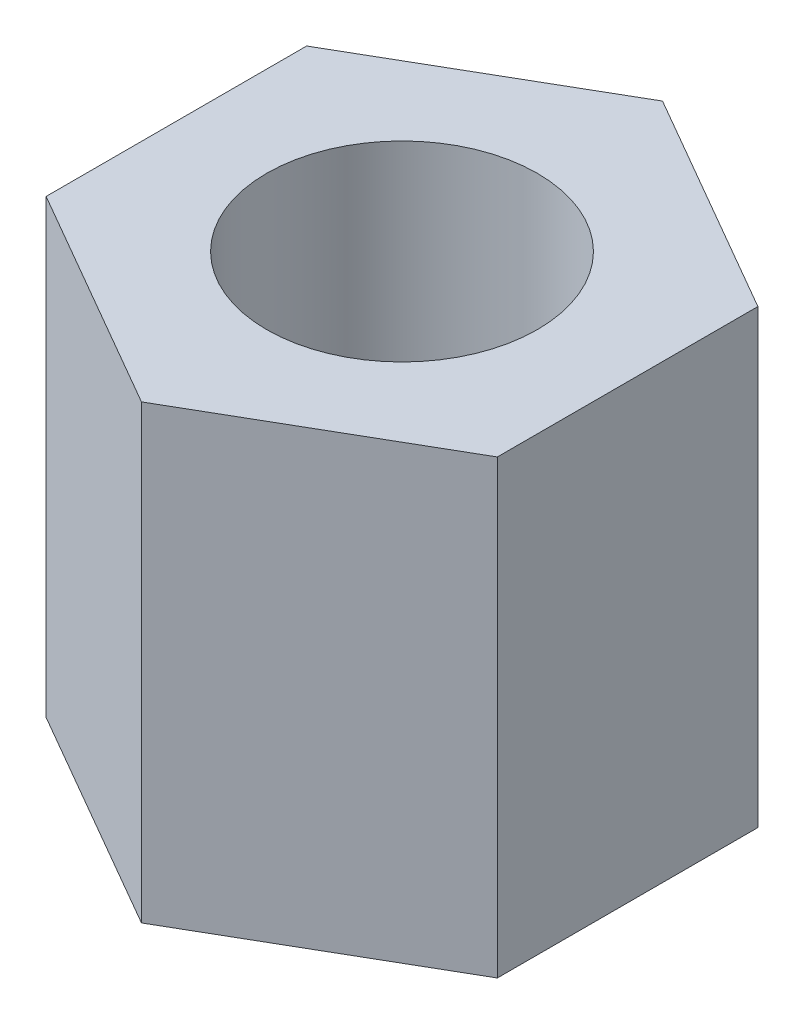
ISO-10303-21;
HEADER;
FILE_DESCRIPTION(('STEP AP214'),'2;1');
FILE_NAME('part.step','',(''),(''),'','','');
FILE_SCHEMA(('AUTOMOTIVE_DESIGN { 1 0 10303 214 1 1 1 1 }'));
ENDSEC;
DATA;
#1=APPLICATION_CONTEXT('core data for automotive mechanical design processes');
#2=APPLICATION_PROTOCOL_DEFINITION('international standard','automotive_design',2000,#1);
#3=PRODUCT_CONTEXT('',#1,'mechanical');
#4=PRODUCT('Part','Part','',(#3));
#5=PRODUCT_RELATED_PRODUCT_CATEGORY('part','',(#4));
#6=PRODUCT_DEFINITION_FORMATION('','',#4);
#7=PRODUCT_DEFINITION_CONTEXT('part definition',#1,'design');
#8=PRODUCT_DEFINITION('design','',#6,#7);
#9=PRODUCT_DEFINITION_SHAPE('','',#8);
#10=(LENGTH_UNIT() NAMED_UNIT(*) SI_UNIT(.MILLI.,.METRE.));
#11=(NAMED_UNIT(*) PLANE_ANGLE_UNIT() SI_UNIT($,.RADIAN.));
#12=(NAMED_UNIT(*) SI_UNIT($,.STERADIAN.) SOLID_ANGLE_UNIT());
#13=UNCERTAINTY_MEASURE_WITH_UNIT(LENGTH_MEASURE(1.E-05),#10,'distance_accuracy_value','');
#14=(GEOMETRIC_REPRESENTATION_CONTEXT(3) GLOBAL_UNCERTAINTY_ASSIGNED_CONTEXT((#13)) GLOBAL_UNIT_ASSIGNED_CONTEXT((#10,
#11,#12)) REPRESENTATION_CONTEXT('',''));
#15=CARTESIAN_POINT('',(0.,0.,0.));
#16=DIRECTION('',(0.,0.,1.));
#17=DIRECTION('',(1.,0.,0.));
#18=AXIS2_PLACEMENT_3D('',#15,#16,#17);
#19=CARTESIAN_POINT('',(0.,6.35,0.));
#20=DIRECTION('',(0.,1.,0.));
#21=DIRECTION('',(0.,0.,1.));
#22=AXIS2_PLACEMENT_3D('',#19,#20,#21);
#23=PLANE('',#22);
#24=DIRECTION('',(0.866025403784442,0.,0.499999999999995));
#25=VECTOR('',#24,1.);
#26=CARTESIAN_POINT('',(-3.17499999999998,6.35,1.8330871046771));
#27=LINE('',#26,#25);
#28=CARTESIAN_POINT('',(-3.17499999999998,6.35,1.8330871046771));
#29=VERTEX_POINT('',#28);
#30=CARTESIAN_POINT('',(0.,6.35,3.66617420935413));
#31=VERTEX_POINT('',#30);
#32=EDGE_CURVE('E129',#29,#31,#27,.T.);
#33=ORIENTED_EDGE('',*,*,#32,.T.);
#34=DIRECTION('',(0.866025403784438,0.,-0.500000000000001));
#35=VECTOR('',#34,1.);
#36=CARTESIAN_POINT('',(0.,6.35,3.66617420935413));
#37=LINE('',#36,#35);
#38=CARTESIAN_POINT('',(3.17500000000001,6.35,1.83308710467706));
#39=VERTEX_POINT('',#38);
#40=EDGE_CURVE('E87',#31,#39,#37,.T.);
#41=ORIENTED_EDGE('',*,*,#40,.T.);
#42=DIRECTION('',(0.,0.,-1.));
#43=VECTOR('',#42,1.);
#44=CARTESIAN_POINT('',(3.17500000000001,6.35,1.83308710467706));
#45=LINE('',#44,#43);
#46=CARTESIAN_POINT('',(3.17499999999999,6.35,-1.83308710467708));
#47=VERTEX_POINT('',#46);
#48=EDGE_CURVE('E100',#39,#47,#45,.T.);
#49=ORIENTED_EDGE('',*,*,#48,.T.);
#50=DIRECTION('',(-0.866025403784442,0.,-0.499999999999995));
#51=VECTOR('',#50,1.);
#52=CARTESIAN_POINT('',(3.17499999999999,6.35,-1.83308710467708));
#53=LINE('',#52,#51);
#54=CARTESIAN_POINT('',(0.,6.35,-3.66617420935413));
#55=VERTEX_POINT('',#54);
#56=EDGE_CURVE('E94',#47,#55,#53,.T.);
#57=ORIENTED_EDGE('',*,*,#56,.T.);
#58=DIRECTION('',(-0.866025403784435,0.,0.500000000000007));
#59=VECTOR('',#58,1.);
#60=CARTESIAN_POINT('',(0.,6.35,-3.66617420935413));
#61=LINE('',#60,#59);
#62=CARTESIAN_POINT('',(-3.17500000000002,6.35,-1.83308710467703));
#63=VERTEX_POINT('',#62);
#64=EDGE_CURVE('E98',#55,#63,#61,.T.);
#65=ORIENTED_EDGE('',*,*,#64,.T.);
#66=DIRECTION('',(0.,0.,1.));
#67=VECTOR('',#66,1.);
#68=CARTESIAN_POINT('',(-3.17500000000002,6.35,-1.83308710467703));
#69=LINE('',#68,#67);
#70=EDGE_CURVE('E50',#63,#29,#69,.T.);
#71=ORIENTED_EDGE('',*,*,#70,.T.);
#72=EDGE_LOOP('',(#33,#41,#49,#57,#65,#71));
#73=FACE_BOUND('',#72,.T.);
#74=CARTESIAN_POINT('',(0.,6.35,0.));
#75=DIRECTION('',(0.,1.,0.));
#76=DIRECTION('',(0.,0.,1.));
#77=AXIS2_PLACEMENT_3D('',#74,#75,#76);
#78=CIRCLE('',#77,1.905);
#79=CARTESIAN_POINT('',(0.,6.35,1.905));
#80=VERTEX_POINT('',#79);
#81=EDGE_CURVE('E122',#80,#80,#78,.T.);
#82=ORIENTED_EDGE('',*,*,#81,.F.);
#83=EDGE_LOOP('',(#82));
#84=FACE_BOUND('',#83,.T.);
#85=ADVANCED_FACE('F33',(#73,#84),#23,.T.);
#86=CARTESIAN_POINT('',(0.,0.,0.));
#87=DIRECTION('',(0.,1.,0.));
#88=DIRECTION('',(0.,0.,1.));
#89=AXIS2_PLACEMENT_3D('',#86,#87,#88);
#90=PLANE('',#89);
#91=DIRECTION('',(0.866025403784442,0.,0.499999999999995));
#92=VECTOR('',#91,1.);
#93=CARTESIAN_POINT('',(-3.17499999999998,0.,1.8330871046771));
#94=LINE('',#93,#92);
#95=CARTESIAN_POINT('',(-3.17499999999998,0.,1.8330871046771));
#96=VERTEX_POINT('',#95);
#97=CARTESIAN_POINT('',(0.,0.,3.66617420935413));
#98=VERTEX_POINT('',#97);
#99=EDGE_CURVE('E118',#96,#98,#94,.T.);
#100=ORIENTED_EDGE('',*,*,#99,.F.);
#101=DIRECTION('',(0.,0.,1.));
#102=VECTOR('',#101,1.);
#103=CARTESIAN_POINT('',(-3.17500000000002,0.,-1.83308710467703));
#104=LINE('',#103,#102);
#105=CARTESIAN_POINT('',(-3.17500000000002,0.,-1.83308710467703));
#106=VERTEX_POINT('',#105);
#107=EDGE_CURVE('E79',#106,#96,#104,.T.);
#108=ORIENTED_EDGE('',*,*,#107,.F.);
#109=DIRECTION('',(-0.866025403784435,0.,0.500000000000007));
#110=VECTOR('',#109,1.);
#111=CARTESIAN_POINT('',(0.,0.,-3.66617420935413));
#112=LINE('',#111,#110);
#113=CARTESIAN_POINT('',(0.,0.,-3.66617420935413));
#114=VERTEX_POINT('',#113);
#115=EDGE_CURVE('E73',#114,#106,#112,.T.);
#116=ORIENTED_EDGE('',*,*,#115,.F.);
#117=DIRECTION('',(-0.866025403784442,0.,-0.499999999999995));
#118=VECTOR('',#117,1.);
#119=CARTESIAN_POINT('',(3.17499999999999,0.,-1.83308710467708));
#120=LINE('',#119,#118);
#121=CARTESIAN_POINT('',(3.17499999999999,0.,-1.83308710467708));
#122=VERTEX_POINT('',#121);
#123=EDGE_CURVE('E108',#122,#114,#120,.T.);
#124=ORIENTED_EDGE('',*,*,#123,.F.);
#125=DIRECTION('',(0.,0.,-1.));
#126=VECTOR('',#125,1.);
#127=CARTESIAN_POINT('',(3.17500000000001,0.,1.83308710467706));
#128=LINE('',#127,#126);
#129=CARTESIAN_POINT('',(3.17500000000001,0.,1.83308710467706));
#130=VERTEX_POINT('',#129);
#131=EDGE_CURVE('E124',#130,#122,#128,.T.);
#132=ORIENTED_EDGE('',*,*,#131,.F.);
#133=DIRECTION('',(0.866025403784438,0.,-0.500000000000001));
#134=VECTOR('',#133,1.);
#135=CARTESIAN_POINT('',(0.,0.,3.66617420935413));
#136=LINE('',#135,#134);
#137=EDGE_CURVE('E121',#98,#130,#136,.T.);
#138=ORIENTED_EDGE('',*,*,#137,.F.);
#139=EDGE_LOOP('',(#100,#108,#116,#124,#132,#138));
#140=FACE_BOUND('',#139,.T.);
#141=CARTESIAN_POINT('',(0.,0.,0.));
#142=DIRECTION('',(0.,1.,0.));
#143=DIRECTION('',(0.,0.,1.));
#144=AXIS2_PLACEMENT_3D('',#141,#142,#143);
#145=CIRCLE('',#144,1.905);
#146=CARTESIAN_POINT('',(0.,0.,1.905));
#147=VERTEX_POINT('',#146);
#148=EDGE_CURVE('E222',#147,#147,#145,.T.);
#149=ORIENTED_EDGE('',*,*,#148,.T.);
#150=EDGE_LOOP('',(#149));
#151=FACE_BOUND('',#150,.T.);
#152=ADVANCED_FACE('F138',(#140,#151),#90,.F.);
#153=CARTESIAN_POINT('',(-3.17499999999998,6.35,1.8330871046771));
#154=DIRECTION('',(0.499999999999995,0.,-0.866025403784441));
#155=DIRECTION('',(-0.866025403784442,0.,-0.499999999999995));
#156=AXIS2_PLACEMENT_3D('',#153,#154,#155);
#157=PLANE('',#156);
#158=ORIENTED_EDGE('',*,*,#99,.T.);
#159=DIRECTION('',(0.,-1.,0.));
#160=VECTOR('',#159,1.);
#161=CARTESIAN_POINT('',(0.,6.35,3.66617420935413));
#162=LINE('',#161,#160);
#163=EDGE_CURVE('E11',#31,#98,#162,.T.);
#164=ORIENTED_EDGE('',*,*,#163,.F.);
#165=ORIENTED_EDGE('',*,*,#32,.F.);
#166=DIRECTION('',(0.,-1.,0.));
#167=VECTOR('',#166,1.);
#168=CARTESIAN_POINT('',(-3.17499999999998,6.35,1.8330871046771));
#169=LINE('',#168,#167);
#170=EDGE_CURVE('E114',#29,#96,#169,.T.);
#171=ORIENTED_EDGE('',*,*,#170,.T.);
#172=EDGE_LOOP('',(#158,#164,#165,#171));
#173=FACE_BOUND('',#172,.T.);
#174=ADVANCED_FACE('F35',(#173),#157,.F.);
#175=CARTESIAN_POINT('',(0.,6.35,3.66617420935413));
#176=DIRECTION('',(-0.500000000000001,0.,-0.866025403784438));
#177=DIRECTION('',(-0.866025403784438,0.,0.500000000000001));
#178=AXIS2_PLACEMENT_3D('',#175,#176,#177);
#179=PLANE('',#178);
#180=ORIENTED_EDGE('',*,*,#137,.T.);
#181=DIRECTION('',(0.,-1.,0.));
#182=VECTOR('',#181,1.);
#183=CARTESIAN_POINT('',(3.17500000000001,6.35,1.83308710467706));
#184=LINE('',#183,#182);
#185=EDGE_CURVE('E42',#39,#130,#184,.T.);
#186=ORIENTED_EDGE('',*,*,#185,.F.);
#187=ORIENTED_EDGE('',*,*,#40,.F.);
#188=ORIENTED_EDGE('',*,*,#163,.T.);
#189=EDGE_LOOP('',(#180,#186,#187,#188));
#190=FACE_BOUND('',#189,.T.);
#191=ADVANCED_FACE('F163',(#190),#179,.F.);
#192=CARTESIAN_POINT('',(3.17500000000001,6.35,1.83308710467706));
#193=DIRECTION('',(-1.,0.,0.));
#194=DIRECTION('',(0.,0.,1.));
#195=AXIS2_PLACEMENT_3D('',#192,#193,#194);
#196=PLANE('',#195);
#197=ORIENTED_EDGE('',*,*,#131,.T.);
#198=DIRECTION('',(0.,-1.,0.));
#199=VECTOR('',#198,1.);
#200=CARTESIAN_POINT('',(3.17499999999999,6.35,-1.83308710467708));
#201=LINE('',#200,#199);
#202=EDGE_CURVE('E109',#47,#122,#201,.T.);
#203=ORIENTED_EDGE('',*,*,#202,.F.);
#204=ORIENTED_EDGE('',*,*,#48,.F.);
#205=ORIENTED_EDGE('',*,*,#185,.T.);
#206=EDGE_LOOP('',(#197,#203,#204,#205));
#207=FACE_BOUND('',#206,.T.);
#208=ADVANCED_FACE('F135',(#207),#196,.F.);
#209=CARTESIAN_POINT('',(3.17499999999999,6.35,-1.83308710467708));
#210=DIRECTION('',(-0.499999999999995,0.,0.866025403784441));
#211=DIRECTION('',(0.866025403784442,0.,0.499999999999995));
#212=AXIS2_PLACEMENT_3D('',#209,#210,#211);
#213=PLANE('',#212);
#214=ORIENTED_EDGE('',*,*,#123,.T.);
#215=DIRECTION('',(0.,-1.,0.));
#216=VECTOR('',#215,1.);
#217=CARTESIAN_POINT('',(0.,6.35,-3.66617420935413));
#218=LINE('',#217,#216);
#219=EDGE_CURVE('E105',#55,#114,#218,.T.);
#220=ORIENTED_EDGE('',*,*,#219,.F.);
#221=ORIENTED_EDGE('',*,*,#56,.F.);
#222=ORIENTED_EDGE('',*,*,#202,.T.);
#223=EDGE_LOOP('',(#214,#220,#221,#222));
#224=FACE_BOUND('',#223,.T.);
#225=ADVANCED_FACE('F106',(#224),#213,.F.);
#226=CARTESIAN_POINT('',(0.,6.35,-3.66617420935413));
#227=DIRECTION('',(0.500000000000007,0.,0.866025403784435));
#228=DIRECTION('',(0.866025403784435,0.,-0.500000000000007));
#229=AXIS2_PLACEMENT_3D('',#226,#227,#228);
#230=PLANE('',#229);
#231=ORIENTED_EDGE('',*,*,#115,.T.);
#232=DIRECTION('',(0.,-1.,0.));
#233=VECTOR('',#232,1.);
#234=CARTESIAN_POINT('',(-3.17500000000002,6.35,-1.83308710467703));
#235=LINE('',#234,#233);
#236=EDGE_CURVE('E110',#63,#106,#235,.T.);
#237=ORIENTED_EDGE('',*,*,#236,.F.);
#238=ORIENTED_EDGE('',*,*,#64,.F.);
#239=ORIENTED_EDGE('',*,*,#219,.T.);
#240=EDGE_LOOP('',(#231,#237,#238,#239));
#241=FACE_BOUND('',#240,.T.);
#242=ADVANCED_FACE('F112',(#241),#230,.F.);
#243=CARTESIAN_POINT('',(-3.17500000000002,6.35,-1.83308710467703));
#244=DIRECTION('',(1.,0.,0.));
#245=DIRECTION('',(0.,0.,-1.));
#246=AXIS2_PLACEMENT_3D('',#243,#244,#245);
#247=PLANE('',#246);
#248=ORIENTED_EDGE('',*,*,#107,.T.);
#249=ORIENTED_EDGE('',*,*,#170,.F.);
#250=ORIENTED_EDGE('',*,*,#70,.F.);
#251=ORIENTED_EDGE('',*,*,#236,.T.);
#252=EDGE_LOOP('',(#248,#249,#250,#251));
#253=FACE_BOUND('',#252,.T.);
#254=ADVANCED_FACE('F143',(#253),#247,.F.);
#255=CARTESIAN_POINT('',(0.,6.35,0.));
#256=DIRECTION('',(0.,-1.,0.));
#257=DIRECTION('',(0.,0.,-1.));
#258=AXIS2_PLACEMENT_3D('',#255,#256,#257);
#259=CYLINDRICAL_SURFACE('',#258,1.905);
#260=ORIENTED_EDGE('',*,*,#81,.T.);
#261=EDGE_LOOP('',(#260));
#262=FACE_BOUND('',#261,.T.);
#263=ORIENTED_EDGE('',*,*,#148,.F.);
#264=EDGE_LOOP('',(#263));
#265=FACE_BOUND('',#264,.T.);
#266=ADVANCED_FACE('F145',(#262,#265),#259,.F.);
#267=CLOSED_SHELL('',(#85,#152,#174,#191,#208,#225,#242,#254,#266));
#268=MANIFOLD_SOLID_BREP('B2',#267);
#269=ADVANCED_BREP_SHAPE_REPRESENTATION('',(#18,#268),#14);
#270=SHAPE_DEFINITION_REPRESENTATION(#9,#269);
ENDSEC;
END-ISO-10303-21;
